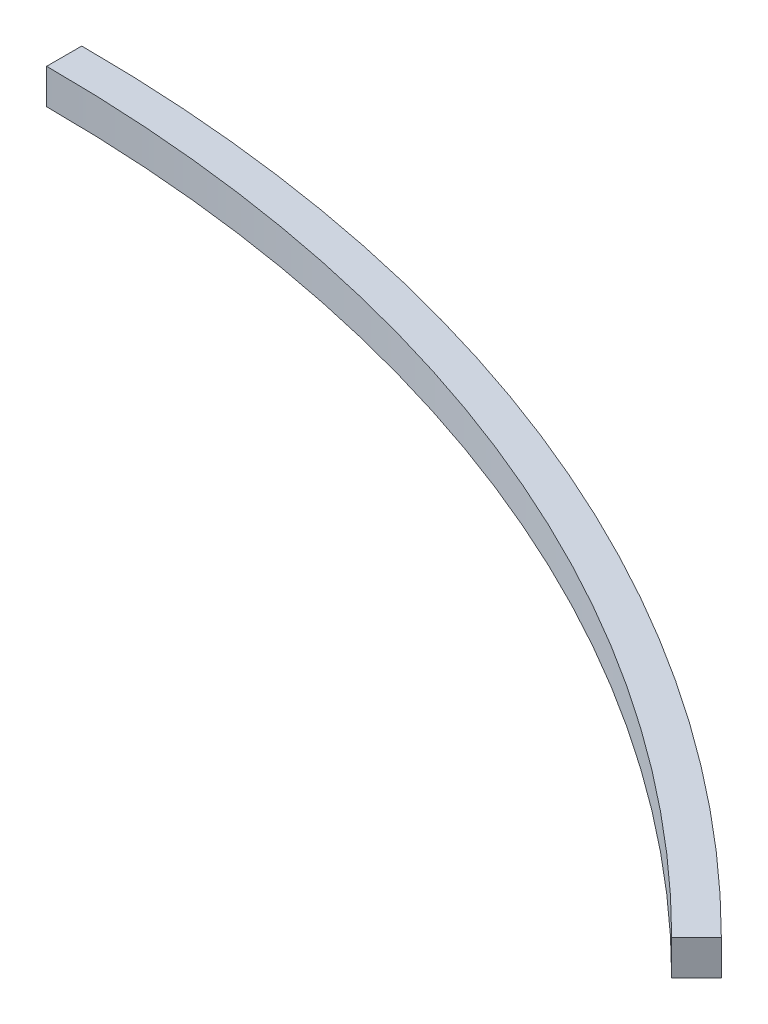
ISO-10303-21;
HEADER;
FILE_DESCRIPTION(('STEP AP214'),'2;1');
FILE_NAME('part.step','',(''),(''),'','','');
FILE_SCHEMA(('AUTOMOTIVE_DESIGN { 1 0 10303 214 1 1 1 1 }'));
ENDSEC;
DATA;
#1=APPLICATION_CONTEXT('core data for automotive mechanical design processes');
#2=APPLICATION_PROTOCOL_DEFINITION('international standard','automotive_design',2000,#1);
#3=PRODUCT_CONTEXT('',#1,'mechanical');
#4=PRODUCT('Part','Part','',(#3));
#5=PRODUCT_RELATED_PRODUCT_CATEGORY('part','',(#4));
#6=PRODUCT_DEFINITION_FORMATION('','',#4);
#7=PRODUCT_DEFINITION_CONTEXT('part definition',#1,'design');
#8=PRODUCT_DEFINITION('design','',#6,#7);
#9=PRODUCT_DEFINITION_SHAPE('','',#8);
#10=(LENGTH_UNIT() NAMED_UNIT(*) SI_UNIT(.MILLI.,.METRE.));
#11=(NAMED_UNIT(*) PLANE_ANGLE_UNIT() SI_UNIT($,.RADIAN.));
#12=(NAMED_UNIT(*) SI_UNIT($,.STERADIAN.) SOLID_ANGLE_UNIT());
#13=UNCERTAINTY_MEASURE_WITH_UNIT(LENGTH_MEASURE(1.E-05),#10,'distance_accuracy_value','');
#14=(GEOMETRIC_REPRESENTATION_CONTEXT(3) GLOBAL_UNCERTAINTY_ASSIGNED_CONTEXT((#13)) GLOBAL_UNIT_ASSIGNED_CONTEXT((#10,
#11,#12)) REPRESENTATION_CONTEXT('',''));
#15=CARTESIAN_POINT('',(0.,0.,0.));
#16=DIRECTION('',(0.,0.,1.));
#17=DIRECTION('',(1.,0.,0.));
#18=AXIS2_PLACEMENT_3D('',#15,#16,#17);
#19=CARTESIAN_POINT('',(0.,10.,0.));
#20=DIRECTION('',(0.,-1.,0.));
#21=DIRECTION('',(0.,0.,-1.));
#22=AXIS2_PLACEMENT_3D('',#19,#20,#21);
#23=CYLINDRICAL_SURFACE('',#22,440.);
#24=CARTESIAN_POINT('',(0.,0.,0.));
#25=DIRECTION('',(0.,1.,0.));
#26=DIRECTION('',(0.,0.,1.));
#27=AXIS2_PLACEMENT_3D('',#24,#25,#26);
#28=CIRCLE('',#27,440.);
#29=CARTESIAN_POINT('',(0.,0.,-440.));
#30=VERTEX_POINT('',#29);
#31=CARTESIAN_POINT('',(311.126983722081,0.,-311.12698372208));
#32=VERTEX_POINT('',#31);
#33=EDGE_CURVE('E99',#30,#32,#28,.F.);
#34=ORIENTED_EDGE('',*,*,#33,.F.);
#35=DIRECTION('',(0.,-1.,0.));
#36=VECTOR('',#35,1.);
#37=CARTESIAN_POINT('',(0.,10.,-440.));
#38=LINE('',#37,#36);
#39=CARTESIAN_POINT('',(0.,10.,-440.));
#40=VERTEX_POINT('',#39);
#41=EDGE_CURVE('E11',#40,#30,#38,.T.);
#42=ORIENTED_EDGE('',*,*,#41,.F.);
#43=CARTESIAN_POINT('',(0.,10.,0.));
#44=DIRECTION('',(0.,1.,0.));
#45=DIRECTION('',(0.,0.,1.));
#46=AXIS2_PLACEMENT_3D('',#43,#44,#45);
#47=CIRCLE('',#46,440.);
#48=CARTESIAN_POINT('',(311.126983722081,10.,-311.12698372208));
#49=VERTEX_POINT('',#48);
#50=EDGE_CURVE('E93',#40,#49,#47,.F.);
#51=ORIENTED_EDGE('',*,*,#50,.T.);
#52=DIRECTION('',(0.,-1.,0.));
#53=VECTOR('',#52,1.);
#54=CARTESIAN_POINT('',(311.126983722081,10.,-311.12698372208));
#55=LINE('',#54,#53);
#56=EDGE_CURVE('E74',#49,#32,#55,.T.);
#57=ORIENTED_EDGE('',*,*,#56,.T.);
#58=EDGE_LOOP('',(#34,#42,#51,#57));
#59=FACE_BOUND('',#58,.T.);
#60=ADVANCED_FACE('F36',(#59),#23,.T.);
#61=CARTESIAN_POINT('',(0.,10.,0.));
#62=DIRECTION('',(-1.,0.,0.));
#63=DIRECTION('',(0.,0.,1.));
#64=AXIS2_PLACEMENT_3D('',#61,#62,#63);
#65=PLANE('',#64);
#66=DIRECTION('',(0.,0.,-1.));
#67=VECTOR('',#66,1.);
#68=CARTESIAN_POINT('',(0.,0.,0.));
#69=LINE('',#68,#67);
#70=CARTESIAN_POINT('',(0.,0.,-430.));
#71=VERTEX_POINT('',#70);
#72=EDGE_CURVE('E87',#71,#30,#69,.T.);
#73=ORIENTED_EDGE('',*,*,#72,.F.);
#74=DIRECTION('',(0.,-1.,0.));
#75=VECTOR('',#74,1.);
#76=CARTESIAN_POINT('',(0.,10.,-430.));
#77=LINE('',#76,#75);
#78=CARTESIAN_POINT('',(0.,10.,-430.));
#79=VERTEX_POINT('',#78);
#80=EDGE_CURVE('E44',#79,#71,#77,.T.);
#81=ORIENTED_EDGE('',*,*,#80,.F.);
#82=DIRECTION('',(0.,0.,-1.));
#83=VECTOR('',#82,1.);
#84=CARTESIAN_POINT('',(0.,10.,0.));
#85=LINE('',#84,#83);
#86=EDGE_CURVE('E85',#79,#40,#85,.T.);
#87=ORIENTED_EDGE('',*,*,#86,.T.);
#88=ORIENTED_EDGE('',*,*,#41,.T.);
#89=EDGE_LOOP('',(#73,#81,#87,#88));
#90=FACE_BOUND('',#89,.T.);
#91=ADVANCED_FACE('F83',(#90),#65,.T.);
#92=CARTESIAN_POINT('',(0.,10.,0.));
#93=DIRECTION('',(0.,-1.,0.));
#94=DIRECTION('',(0.,0.,-1.));
#95=AXIS2_PLACEMENT_3D('',#92,#93,#94);
#96=CYLINDRICAL_SURFACE('',#95,430.);
#97=CARTESIAN_POINT('',(0.,0.,0.));
#98=DIRECTION('',(0.,1.,0.));
#99=DIRECTION('',(0.,0.,1.));
#100=AXIS2_PLACEMENT_3D('',#97,#98,#99);
#101=CIRCLE('',#100,430.);
#102=CARTESIAN_POINT('',(304.055915910216,0.,-304.055915910215));
#103=VERTEX_POINT('',#102);
#104=EDGE_CURVE('E67',#71,#103,#101,.F.);
#105=ORIENTED_EDGE('',*,*,#104,.T.);
#106=DIRECTION('',(0.,-1.,0.));
#107=VECTOR('',#106,1.);
#108=CARTESIAN_POINT('',(304.055915910216,10.,-304.055915910215));
#109=LINE('',#108,#107);
#110=CARTESIAN_POINT('',(304.055915910216,10.,-304.055915910215));
#111=VERTEX_POINT('',#110);
#112=EDGE_CURVE('E88',#111,#103,#109,.T.);
#113=ORIENTED_EDGE('',*,*,#112,.F.);
#114=CARTESIAN_POINT('',(0.,10.,0.));
#115=DIRECTION('',(0.,1.,0.));
#116=DIRECTION('',(0.,0.,1.));
#117=AXIS2_PLACEMENT_3D('',#114,#115,#116);
#118=CIRCLE('',#117,430.);
#119=EDGE_CURVE('E89',#79,#111,#118,.F.);
#120=ORIENTED_EDGE('',*,*,#119,.F.);
#121=ORIENTED_EDGE('',*,*,#80,.T.);
#122=EDGE_LOOP('',(#105,#113,#120,#121));
#123=FACE_BOUND('',#122,.T.);
#124=ADVANCED_FACE('F90',(#123),#96,.F.);
#125=CARTESIAN_POINT('',(4.71027737605132E-13,10.,4.71027737605132E-13));
#126=DIRECTION('',(-0.707106781186548,0.,-0.707106781186548));
#127=DIRECTION('',(-0.707106781186548,0.,0.707106781186548));
#128=AXIS2_PLACEMENT_3D('',#125,#126,#127);
#129=PLANE('',#128);
#130=DIRECTION('',(0.707106781186548,0.,-0.707106781186548));
#131=VECTOR('',#130,1.);
#132=CARTESIAN_POINT('',(4.71027737605132E-13,0.,4.71027737605132E-13));
#133=LINE('',#132,#131);
#134=EDGE_CURVE('E95',#103,#32,#133,.T.);
#135=ORIENTED_EDGE('',*,*,#134,.T.);
#136=ORIENTED_EDGE('',*,*,#56,.F.);
#137=DIRECTION('',(0.707106781186548,0.,-0.707106781186548));
#138=VECTOR('',#137,1.);
#139=CARTESIAN_POINT('',(4.71027737605132E-13,10.,4.71027737605132E-13));
#140=LINE('',#139,#138);
#141=EDGE_CURVE('E52',#111,#49,#140,.T.);
#142=ORIENTED_EDGE('',*,*,#141,.F.);
#143=ORIENTED_EDGE('',*,*,#112,.T.);
#144=EDGE_LOOP('',(#135,#136,#142,#143));
#145=FACE_BOUND('',#144,.T.);
#146=ADVANCED_FACE('F108',(#145),#129,.F.);
#147=CARTESIAN_POINT('',(0.,10.,0.));
#148=DIRECTION('',(0.,1.,0.));
#149=DIRECTION('',(0.,0.,1.));
#150=AXIS2_PLACEMENT_3D('',#147,#148,#149);
#151=PLANE('',#150);
#152=ORIENTED_EDGE('',*,*,#50,.F.);
#153=ORIENTED_EDGE('',*,*,#86,.F.);
#154=ORIENTED_EDGE('',*,*,#119,.T.);
#155=ORIENTED_EDGE('',*,*,#141,.T.);
#156=EDGE_LOOP('',(#152,#153,#154,#155));
#157=FACE_BOUND('',#156,.T.);
#158=ADVANCED_FACE('F92',(#157),#151,.T.);
#159=CARTESIAN_POINT('',(0.,0.,0.));
#160=DIRECTION('',(0.,1.,0.));
#161=DIRECTION('',(0.,0.,1.));
#162=AXIS2_PLACEMENT_3D('',#159,#160,#161);
#163=PLANE('',#162);
#164=ORIENTED_EDGE('',*,*,#33,.T.);
#165=ORIENTED_EDGE('',*,*,#134,.F.);
#166=ORIENTED_EDGE('',*,*,#104,.F.);
#167=ORIENTED_EDGE('',*,*,#72,.T.);
#168=EDGE_LOOP('',(#164,#165,#166,#167));
#169=FACE_BOUND('',#168,.T.);
#170=ADVANCED_FACE('F110',(#169),#163,.F.);
#171=CLOSED_SHELL('',(#60,#91,#124,#146,#158,#170));
#172=MANIFOLD_SOLID_BREP('B2',#171);
#173=ADVANCED_BREP_SHAPE_REPRESENTATION('',(#18,#172),#14);
#174=SHAPE_DEFINITION_REPRESENTATION(#9,#173);
ENDSEC;
END-ISO-10303-21;
